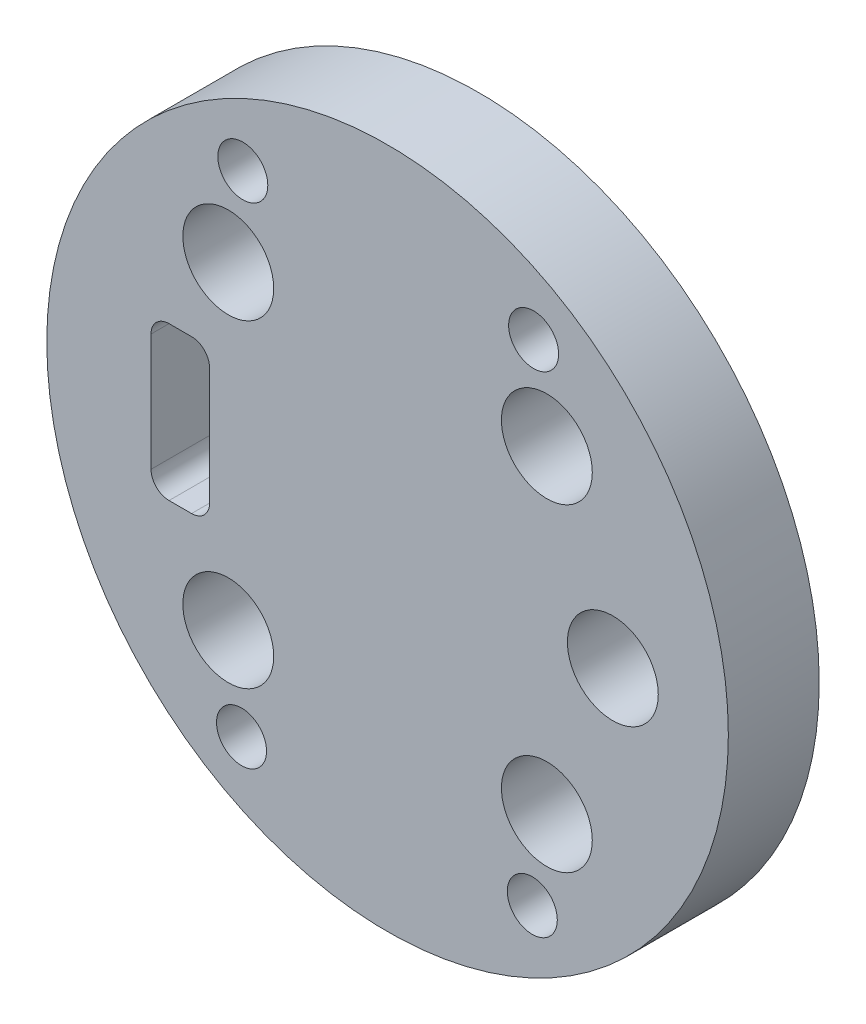
ISO-10303-21;
HEADER;
FILE_DESCRIPTION(('STEP AP214'),'2;1');
FILE_NAME('part.step','',(''),(''),'','','');
FILE_SCHEMA(('AUTOMOTIVE_DESIGN { 1 0 10303 214 1 1 1 1 }'));
ENDSEC;
DATA;
#1=APPLICATION_CONTEXT('core data for automotive mechanical design processes');
#2=APPLICATION_PROTOCOL_DEFINITION('international standard','automotive_design',2000,#1);
#3=PRODUCT_CONTEXT('',#1,'mechanical');
#4=PRODUCT('Part','Part','',(#3));
#5=PRODUCT_RELATED_PRODUCT_CATEGORY('part','',(#4));
#6=PRODUCT_DEFINITION_FORMATION('','',#4);
#7=PRODUCT_DEFINITION_CONTEXT('part definition',#1,'design');
#8=PRODUCT_DEFINITION('design','',#6,#7);
#9=PRODUCT_DEFINITION_SHAPE('','',#8);
#10=(LENGTH_UNIT() NAMED_UNIT(*) SI_UNIT(.MILLI.,.METRE.));
#11=(NAMED_UNIT(*) PLANE_ANGLE_UNIT() SI_UNIT($,.RADIAN.));
#12=(NAMED_UNIT(*) SI_UNIT($,.STERADIAN.) SOLID_ANGLE_UNIT());
#13=UNCERTAINTY_MEASURE_WITH_UNIT(LENGTH_MEASURE(1.E-05),#10,'distance_accuracy_value','');
#14=(GEOMETRIC_REPRESENTATION_CONTEXT(3) GLOBAL_UNCERTAINTY_ASSIGNED_CONTEXT((#13)) GLOBAL_UNIT_ASSIGNED_CONTEXT((#10,
#11,#12)) REPRESENTATION_CONTEXT('',''));
#15=CARTESIAN_POINT('',(0.,0.,0.));
#16=DIRECTION('',(0.,0.,1.));
#17=DIRECTION('',(1.,0.,0.));
#18=AXIS2_PLACEMENT_3D('',#15,#16,#17);
#19=CARTESIAN_POINT('',(-21.5665264060091,6.44516881099122,10.));
#20=DIRECTION('',(0.,0.,-1.));
#21=DIRECTION('',(-1.,0.,0.));
#22=AXIS2_PLACEMENT_3D('',#19,#20,#21);
#23=CYLINDRICAL_SURFACE('',#22,1.98312886492038);
#24=CARTESIAN_POINT('',(-21.5665264060091,6.44516881099122,0.));
#25=DIRECTION('',(0.,0.,1.));
#26=DIRECTION('',(1.,0.,0.));
#27=AXIS2_PLACEMENT_3D('',#24,#25,#26);
#28=CIRCLE('',#27,1.98312886492038);
#29=CARTESIAN_POINT('',(-19.5833975410887,6.44516881099122,0.));
#30=VERTEX_POINT('',#29);
#31=CARTESIAN_POINT('',(-21.5665264060091,8.42829767591159,0.));
#32=VERTEX_POINT('',#31);
#33=EDGE_CURVE('E144',#30,#32,#28,.T.);
#34=ORIENTED_EDGE('',*,*,#33,.F.);
#35=DIRECTION('',(0.,0.,-1.));
#36=VECTOR('',#35,1.);
#37=CARTESIAN_POINT('',(-19.5833975410887,6.44516881099122,10.));
#38=LINE('',#37,#36);
#39=CARTESIAN_POINT('',(-19.5833975410887,6.44516881099122,10.));
#40=VERTEX_POINT('',#39);
#41=EDGE_CURVE('E11',#40,#30,#38,.T.);
#42=ORIENTED_EDGE('',*,*,#41,.F.);
#43=CARTESIAN_POINT('',(-21.5665264060091,6.44516881099122,10.));
#44=DIRECTION('',(0.,0.,1.));
#45=DIRECTION('',(1.,0.,0.));
#46=AXIS2_PLACEMENT_3D('',#43,#44,#45);
#47=CIRCLE('',#46,1.98312886492038);
#48=CARTESIAN_POINT('',(-21.5665264060091,8.42829767591159,10.));
#49=VERTEX_POINT('',#48);
#50=EDGE_CURVE('E177',#40,#49,#47,.T.);
#51=ORIENTED_EDGE('',*,*,#50,.T.);
#52=DIRECTION('',(0.,0.,-1.));
#53=VECTOR('',#52,1.);
#54=CARTESIAN_POINT('',(-21.5665264060091,8.42829767591159,10.));
#55=LINE('',#54,#53);
#56=EDGE_CURVE('E58',#49,#32,#55,.T.);
#57=ORIENTED_EDGE('',*,*,#56,.T.);
#58=EDGE_LOOP('',(#34,#42,#51,#57));
#59=FACE_BOUND('',#58,.T.);
#60=ADVANCED_FACE('F41',(#59),#23,.F.);
#61=CARTESIAN_POINT('',(-19.5833975410887,0.,10.));
#62=DIRECTION('',(-1.,0.,0.));
#63=DIRECTION('',(0.,0.,1.));
#64=AXIS2_PLACEMENT_3D('',#61,#62,#63);
#65=PLANE('',#64);
#66=DIRECTION('',(0.,1.,0.));
#67=VECTOR('',#66,1.);
#68=CARTESIAN_POINT('',(-19.5833975410887,0.,0.));
#69=LINE('',#68,#67);
#70=CARTESIAN_POINT('',(-19.5833975410887,-6.44516881099122,0.));
#71=VERTEX_POINT('',#70);
#72=EDGE_CURVE('E147',#71,#30,#69,.T.);
#73=ORIENTED_EDGE('',*,*,#72,.F.);
#74=DIRECTION('',(0.,0.,-1.));
#75=VECTOR('',#74,1.);
#76=CARTESIAN_POINT('',(-19.5833975410887,-6.44516881099122,10.));
#77=LINE('',#76,#75);
#78=CARTESIAN_POINT('',(-19.5833975410887,-6.44516881099122,10.));
#79=VERTEX_POINT('',#78);
#80=EDGE_CURVE('E50',#79,#71,#77,.T.);
#81=ORIENTED_EDGE('',*,*,#80,.F.);
#82=DIRECTION('',(0.,1.,0.));
#83=VECTOR('',#82,1.);
#84=CARTESIAN_POINT('',(-19.5833975410887,0.,10.));
#85=LINE('',#84,#83);
#86=EDGE_CURVE('E210',#79,#40,#85,.T.);
#87=ORIENTED_EDGE('',*,*,#86,.T.);
#88=ORIENTED_EDGE('',*,*,#41,.T.);
#89=EDGE_LOOP('',(#73,#81,#87,#88));
#90=FACE_BOUND('',#89,.T.);
#91=ADVANCED_FACE('F200',(#90),#65,.T.);
#92=CARTESIAN_POINT('',(-21.5665264060091,-6.44516881099122,10.));
#93=DIRECTION('',(0.,0.,-1.));
#94=DIRECTION('',(-1.,0.,0.));
#95=AXIS2_PLACEMENT_3D('',#92,#93,#94);
#96=CYLINDRICAL_SURFACE('',#95,1.98312886492037);
#97=CARTESIAN_POINT('',(-21.5665264060091,-6.44516881099122,0.));
#98=DIRECTION('',(0.,0.,1.));
#99=DIRECTION('',(1.,0.,0.));
#100=AXIS2_PLACEMENT_3D('',#97,#98,#99);
#101=CIRCLE('',#100,1.98312886492037);
#102=CARTESIAN_POINT('',(-21.5665264060091,-8.42829767591159,0.));
#103=VERTEX_POINT('',#102);
#104=EDGE_CURVE('E152',#103,#71,#101,.T.);
#105=ORIENTED_EDGE('',*,*,#104,.F.);
#106=DIRECTION('',(0.,0.,-1.));
#107=VECTOR('',#106,1.);
#108=CARTESIAN_POINT('',(-21.5665264060091,-8.42829767591159,10.));
#109=LINE('',#108,#107);
#110=CARTESIAN_POINT('',(-21.5665264060091,-8.42829767591159,10.));
#111=VERTEX_POINT('',#110);
#112=EDGE_CURVE('E187',#111,#103,#109,.T.);
#113=ORIENTED_EDGE('',*,*,#112,.F.);
#114=CARTESIAN_POINT('',(-21.5665264060091,-6.44516881099122,10.));
#115=DIRECTION('',(0.,0.,1.));
#116=DIRECTION('',(1.,0.,0.));
#117=AXIS2_PLACEMENT_3D('',#114,#115,#116);
#118=CIRCLE('',#117,1.98312886492037);
#119=EDGE_CURVE('E196',#111,#79,#118,.T.);
#120=ORIENTED_EDGE('',*,*,#119,.T.);
#121=ORIENTED_EDGE('',*,*,#80,.T.);
#122=EDGE_LOOP('',(#105,#113,#120,#121));
#123=FACE_BOUND('',#122,.T.);
#124=ADVANCED_FACE('F194',(#123),#96,.F.);
#125=CARTESIAN_POINT('',(0.,-8.42829767591159,10.));
#126=DIRECTION('',(0.,1.,0.));
#127=DIRECTION('',(0.,0.,1.));
#128=AXIS2_PLACEMENT_3D('',#125,#126,#127);
#129=PLANE('',#128);
#130=DIRECTION('',(1.,0.,0.));
#131=VECTOR('',#130,1.);
#132=CARTESIAN_POINT('',(0.,-8.42829767591159,0.));
#133=LINE('',#132,#131);
#134=CARTESIAN_POINT('',(-24.0454374871595,-8.42829767591159,0.));
#135=VERTEX_POINT('',#134);
#136=EDGE_CURVE('E156',#135,#103,#133,.T.);
#137=ORIENTED_EDGE('',*,*,#136,.F.);
#138=DIRECTION('',(0.,0.,-1.));
#139=VECTOR('',#138,1.);
#140=CARTESIAN_POINT('',(-24.0454374871595,-8.42829767591159,10.));
#141=LINE('',#140,#139);
#142=CARTESIAN_POINT('',(-24.0454374871595,-8.42829767591159,10.));
#143=VERTEX_POINT('',#142);
#144=EDGE_CURVE('E184',#143,#135,#141,.T.);
#145=ORIENTED_EDGE('',*,*,#144,.F.);
#146=DIRECTION('',(1.,0.,0.));
#147=VECTOR('',#146,1.);
#148=CARTESIAN_POINT('',(0.,-8.42829767591159,10.));
#149=LINE('',#148,#147);
#150=EDGE_CURVE('E209',#143,#111,#149,.T.);
#151=ORIENTED_EDGE('',*,*,#150,.T.);
#152=ORIENTED_EDGE('',*,*,#112,.T.);
#153=EDGE_LOOP('',(#137,#145,#151,#152));
#154=FACE_BOUND('',#153,.T.);
#155=ADVANCED_FACE('F207',(#154),#129,.T.);
#156=CARTESIAN_POINT('',(-24.0454374871595,-6.44516881099122,10.));
#157=DIRECTION('',(0.,0.,-1.));
#158=DIRECTION('',(-1.,0.,0.));
#159=AXIS2_PLACEMENT_3D('',#156,#157,#158);
#160=CYLINDRICAL_SURFACE('',#159,1.98312886492037);
#161=CARTESIAN_POINT('',(-24.0454374871595,-6.44516881099122,0.));
#162=DIRECTION('',(0.,0.,1.));
#163=DIRECTION('',(1.,0.,0.));
#164=AXIS2_PLACEMENT_3D('',#161,#162,#163);
#165=CIRCLE('',#164,1.98312886492037);
#166=CARTESIAN_POINT('',(-26.0285663520799,-6.44516881099122,0.));
#167=VERTEX_POINT('',#166);
#168=EDGE_CURVE('E160',#167,#135,#165,.T.);
#169=ORIENTED_EDGE('',*,*,#168,.F.);
#170=DIRECTION('',(0.,0.,-1.));
#171=VECTOR('',#170,1.);
#172=CARTESIAN_POINT('',(-26.0285663520799,-6.44516881099122,10.));
#173=LINE('',#172,#171);
#174=CARTESIAN_POINT('',(-26.0285663520799,-6.44516881099122,10.));
#175=VERTEX_POINT('',#174);
#176=EDGE_CURVE('E118',#175,#167,#173,.T.);
#177=ORIENTED_EDGE('',*,*,#176,.F.);
#178=CARTESIAN_POINT('',(-24.0454374871595,-6.44516881099122,10.));
#179=DIRECTION('',(0.,0.,1.));
#180=DIRECTION('',(1.,0.,0.));
#181=AXIS2_PLACEMENT_3D('',#178,#179,#180);
#182=CIRCLE('',#181,1.98312886492037);
#183=EDGE_CURVE('E129',#175,#143,#182,.T.);
#184=ORIENTED_EDGE('',*,*,#183,.T.);
#185=ORIENTED_EDGE('',*,*,#144,.T.);
#186=EDGE_LOOP('',(#169,#177,#184,#185));
#187=FACE_BOUND('',#186,.T.);
#188=ADVANCED_FACE('F220',(#187),#160,.F.);
#189=CARTESIAN_POINT('',(-26.0285663520799,0.,10.));
#190=DIRECTION('',(1.,0.,0.));
#191=DIRECTION('',(0.,0.,-1.));
#192=AXIS2_PLACEMENT_3D('',#189,#190,#191);
#193=PLANE('',#192);
#194=DIRECTION('',(0.,-1.,0.));
#195=VECTOR('',#194,1.);
#196=CARTESIAN_POINT('',(-26.0285663520799,0.,0.));
#197=LINE('',#196,#195);
#198=CARTESIAN_POINT('',(-26.0285663520799,6.44516881099122,0.));
#199=VERTEX_POINT('',#198);
#200=EDGE_CURVE('E113',#199,#167,#197,.T.);
#201=ORIENTED_EDGE('',*,*,#200,.F.);
#202=DIRECTION('',(0.,0.,-1.));
#203=VECTOR('',#202,1.);
#204=CARTESIAN_POINT('',(-26.0285663520799,6.44516881099122,10.));
#205=LINE('',#204,#203);
#206=CARTESIAN_POINT('',(-26.0285663520799,6.44516881099122,10.));
#207=VERTEX_POINT('',#206);
#208=EDGE_CURVE('E108',#207,#199,#205,.T.);
#209=ORIENTED_EDGE('',*,*,#208,.F.);
#210=DIRECTION('',(0.,-1.,0.));
#211=VECTOR('',#210,1.);
#212=CARTESIAN_POINT('',(-26.0285663520799,0.,10.));
#213=LINE('',#212,#211);
#214=EDGE_CURVE('E111',#207,#175,#213,.T.);
#215=ORIENTED_EDGE('',*,*,#214,.T.);
#216=ORIENTED_EDGE('',*,*,#176,.T.);
#217=EDGE_LOOP('',(#201,#209,#215,#216));
#218=FACE_BOUND('',#217,.T.);
#219=ADVANCED_FACE('F110',(#218),#193,.T.);
#220=CARTESIAN_POINT('',(-24.0454374871595,6.44516881099122,10.));
#221=DIRECTION('',(0.,0.,-1.));
#222=DIRECTION('',(-1.,0.,0.));
#223=AXIS2_PLACEMENT_3D('',#220,#221,#222);
#224=CYLINDRICAL_SURFACE('',#223,1.98312886492037);
#225=CARTESIAN_POINT('',(-24.0454374871595,6.44516881099122,0.));
#226=DIRECTION('',(0.,0.,1.));
#227=DIRECTION('',(1.,0.,0.));
#228=AXIS2_PLACEMENT_3D('',#225,#226,#227);
#229=CIRCLE('',#228,1.98312886492037);
#230=CARTESIAN_POINT('',(-24.0454374871595,8.42829767591159,0.));
#231=VERTEX_POINT('',#230);
#232=EDGE_CURVE('E166',#231,#199,#229,.T.);
#233=ORIENTED_EDGE('',*,*,#232,.F.);
#234=DIRECTION('',(0.,0.,-1.));
#235=VECTOR('',#234,1.);
#236=CARTESIAN_POINT('',(-24.0454374871595,8.42829767591159,10.));
#237=LINE('',#236,#235);
#238=CARTESIAN_POINT('',(-24.0454374871595,8.42829767591159,10.));
#239=VERTEX_POINT('',#238);
#240=EDGE_CURVE('E83',#239,#231,#237,.T.);
#241=ORIENTED_EDGE('',*,*,#240,.F.);
#242=CARTESIAN_POINT('',(-24.0454374871595,6.44516881099122,10.));
#243=DIRECTION('',(0.,0.,1.));
#244=DIRECTION('',(1.,0.,0.));
#245=AXIS2_PLACEMENT_3D('',#242,#243,#244);
#246=CIRCLE('',#245,1.98312886492037);
#247=EDGE_CURVE('E126',#239,#207,#246,.T.);
#248=ORIENTED_EDGE('',*,*,#247,.T.);
#249=ORIENTED_EDGE('',*,*,#208,.T.);
#250=EDGE_LOOP('',(#233,#241,#248,#249));
#251=FACE_BOUND('',#250,.T.);
#252=ADVANCED_FACE('F132',(#251),#224,.F.);
#253=CARTESIAN_POINT('',(0.,8.42829767591159,10.));
#254=DIRECTION('',(0.,-1.,0.));
#255=DIRECTION('',(0.,0.,-1.));
#256=AXIS2_PLACEMENT_3D('',#253,#254,#255);
#257=PLANE('',#256);
#258=DIRECTION('',(-1.,0.,0.));
#259=VECTOR('',#258,1.);
#260=CARTESIAN_POINT('',(0.,8.42829767591159,0.));
#261=LINE('',#260,#259);
#262=EDGE_CURVE('E169',#32,#231,#261,.T.);
#263=ORIENTED_EDGE('',*,*,#262,.F.);
#264=ORIENTED_EDGE('',*,*,#56,.F.);
#265=DIRECTION('',(-1.,0.,0.));
#266=VECTOR('',#265,1.);
#267=CARTESIAN_POINT('',(0.,8.42829767591159,10.));
#268=LINE('',#267,#266);
#269=EDGE_CURVE('E134',#49,#239,#268,.T.);
#270=ORIENTED_EDGE('',*,*,#269,.T.);
#271=ORIENTED_EDGE('',*,*,#240,.T.);
#272=EDGE_LOOP('',(#263,#264,#270,#271));
#273=FACE_BOUND('',#272,.T.);
#274=ADVANCED_FACE('F221',(#273),#257,.T.);
#275=CARTESIAN_POINT('',(0.,0.,10.));
#276=DIRECTION('',(0.,0.,-1.));
#277=DIRECTION('',(-1.,0.,0.));
#278=AXIS2_PLACEMENT_3D('',#275,#276,#277);
#279=CYLINDRICAL_SURFACE('',#278,37.5);
#280=CARTESIAN_POINT('',(0.,0.,10.));
#281=DIRECTION('',(0.,0.,1.));
#282=DIRECTION('',(1.,0.,0.));
#283=AXIS2_PLACEMENT_3D('',#280,#281,#282);
#284=CIRCLE('',#283,37.5);
#285=CARTESIAN_POINT('',(37.5,0.,10.));
#286=VERTEX_POINT('',#285);
#287=EDGE_CURVE('E137',#286,#286,#284,.T.);
#288=ORIENTED_EDGE('',*,*,#287,.F.);
#289=EDGE_LOOP('',(#288));
#290=FACE_BOUND('',#289,.T.);
#291=CARTESIAN_POINT('',(0.,0.,0.));
#292=DIRECTION('',(0.,0.,1.));
#293=DIRECTION('',(1.,0.,0.));
#294=AXIS2_PLACEMENT_3D('',#291,#292,#293);
#295=CIRCLE('',#294,37.5);
#296=CARTESIAN_POINT('',(37.5,0.,0.));
#297=VERTEX_POINT('',#296);
#298=EDGE_CURVE('E173',#297,#297,#295,.T.);
#299=ORIENTED_EDGE('',*,*,#298,.T.);
#300=EDGE_LOOP('',(#299));
#301=FACE_BOUND('',#300,.T.);
#302=ADVANCED_FACE('F223',(#290,#301),#279,.T.);
#303=CARTESIAN_POINT('',(0.,0.,10.));
#304=DIRECTION('',(0.,0.,1.));
#305=DIRECTION('',(1.,0.,0.));
#306=AXIS2_PLACEMENT_3D('',#303,#304,#305);
#307=PLANE('',#306);
#308=CARTESIAN_POINT('',(-15.9288241092373,27.0420517434788,10.));
#309=DIRECTION('',(0.,0.,1.));
#310=DIRECTION('',(1.,0.,0.));
#311=AXIS2_PLACEMENT_3D('',#308,#309,#310);
#312=CIRCLE('',#311,2.75);
#313=CARTESIAN_POINT('',(-13.1788241092373,27.0420517434788,10.));
#314=VERTEX_POINT('',#313);
#315=EDGE_CURVE('E382',#314,#314,#312,.T.);
#316=ORIENTED_EDGE('',*,*,#315,.F.);
#317=EDGE_LOOP('',(#316));
#318=FACE_BOUND('',#317,.T.);
#319=CARTESIAN_POINT('',(16.0710648758339,26.9577609188289,10.));
#320=DIRECTION('',(0.,0.,1.));
#321=DIRECTION('',(1.,0.,0.));
#322=AXIS2_PLACEMENT_3D('',#319,#320,#321);
#323=CIRCLE('',#322,2.74999999999999);
#324=CARTESIAN_POINT('',(18.8210648758339,26.9577609188289,10.));
#325=VERTEX_POINT('',#324);
#326=EDGE_CURVE('E386',#325,#325,#323,.T.);
#327=ORIENTED_EDGE('',*,*,#326,.F.);
#328=EDGE_LOOP('',(#327));
#329=FACE_BOUND('',#328,.T.);
#330=CARTESIAN_POINT('',(15.9288241092373,-27.0420517434787,10.));
#331=DIRECTION('',(0.,0.,1.));
#332=DIRECTION('',(1.,0.,0.));
#333=AXIS2_PLACEMENT_3D('',#330,#331,#332);
#334=CIRCLE('',#333,2.75);
#335=CARTESIAN_POINT('',(18.6788241092373,-27.0420517434787,10.));
#336=VERTEX_POINT('',#335);
#337=EDGE_CURVE('E441',#336,#336,#334,.T.);
#338=ORIENTED_EDGE('',*,*,#337,.F.);
#339=EDGE_LOOP('',(#338));
#340=FACE_BOUND('',#339,.T.);
#341=CARTESIAN_POINT('',(-16.0710648758339,-26.9577609188289,10.));
#342=DIRECTION('',(0.,0.,1.));
#343=DIRECTION('',(1.,0.,0.));
#344=AXIS2_PLACEMENT_3D('',#341,#342,#343);
#345=CIRCLE('',#344,2.74999999999999);
#346=CARTESIAN_POINT('',(-13.3210648758339,-26.9577609188289,10.));
#347=VERTEX_POINT('',#346);
#348=EDGE_CURVE('E395',#347,#347,#345,.T.);
#349=ORIENTED_EDGE('',*,*,#348,.F.);
#350=EDGE_LOOP('',(#349));
#351=FACE_BOUND('',#350,.T.);
#352=CARTESIAN_POINT('',(17.5285483543997,17.5285483543997,10.));
#353=DIRECTION('',(0.,0.,1.));
#354=DIRECTION('',(1.,0.,0.));
#355=AXIS2_PLACEMENT_3D('',#352,#353,#354);
#356=CIRCLE('',#355,5.);
#357=CARTESIAN_POINT('',(22.5285483543997,17.5285483543997,10.));
#358=VERTEX_POINT('',#357);
#359=EDGE_CURVE('E421',#358,#358,#356,.T.);
#360=ORIENTED_EDGE('',*,*,#359,.F.);
#361=EDGE_LOOP('',(#360));
#362=FACE_BOUND('',#361,.T.);
#363=CARTESIAN_POINT('',(-17.5285483543997,-17.5285483543997,10.));
#364=DIRECTION('',(0.,0.,1.));
#365=DIRECTION('',(1.,0.,0.));
#366=AXIS2_PLACEMENT_3D('',#363,#364,#365);
#367=CIRCLE('',#366,5.);
#368=CARTESIAN_POINT('',(-12.5285483543997,-17.5285483543997,10.));
#369=VERTEX_POINT('',#368);
#370=EDGE_CURVE('E404',#369,#369,#367,.T.);
#371=ORIENTED_EDGE('',*,*,#370,.F.);
#372=EDGE_LOOP('',(#371));
#373=FACE_BOUND('',#372,.T.);
#374=CARTESIAN_POINT('',(17.5285483543997,-17.5285483543997,10.));
#375=DIRECTION('',(0.,0.,1.));
#376=DIRECTION('',(1.,0.,0.));
#377=AXIS2_PLACEMENT_3D('',#374,#375,#376);
#378=CIRCLE('',#377,5.);
#379=CARTESIAN_POINT('',(22.5285483543997,-17.5285483543997,10.));
#380=VERTEX_POINT('',#379);
#381=EDGE_CURVE('E405',#380,#380,#378,.T.);
#382=ORIENTED_EDGE('',*,*,#381,.F.);
#383=EDGE_LOOP('',(#382));
#384=FACE_BOUND('',#383,.T.);
#385=CARTESIAN_POINT('',(24.7891108115047,0.,10.));
#386=DIRECTION('',(0.,0.,1.));
#387=DIRECTION('',(1.,0.,0.));
#388=AXIS2_PLACEMENT_3D('',#385,#386,#387);
#389=CIRCLE('',#388,5.);
#390=CARTESIAN_POINT('',(29.7891108115047,0.,10.));
#391=VERTEX_POINT('',#390);
#392=EDGE_CURVE('E394',#391,#391,#389,.T.);
#393=ORIENTED_EDGE('',*,*,#392,.F.);
#394=EDGE_LOOP('',(#393));
#395=FACE_BOUND('',#394,.T.);
#396=CARTESIAN_POINT('',(-17.5285483543997,17.5285483543997,10.));
#397=DIRECTION('',(0.,0.,1.));
#398=DIRECTION('',(1.,0.,0.));
#399=AXIS2_PLACEMENT_3D('',#396,#397,#398);
#400=CIRCLE('',#399,5.);
#401=CARTESIAN_POINT('',(-12.5285483543997,17.5285483543997,10.));
#402=VERTEX_POINT('',#401);
#403=EDGE_CURVE('E420',#402,#402,#400,.T.);
#404=ORIENTED_EDGE('',*,*,#403,.F.);
#405=EDGE_LOOP('',(#404));
#406=FACE_BOUND('',#405,.T.);
#407=ORIENTED_EDGE('',*,*,#50,.F.);
#408=ORIENTED_EDGE('',*,*,#86,.F.);
#409=ORIENTED_EDGE('',*,*,#119,.F.);
#410=ORIENTED_EDGE('',*,*,#150,.F.);
#411=ORIENTED_EDGE('',*,*,#183,.F.);
#412=ORIENTED_EDGE('',*,*,#214,.F.);
#413=ORIENTED_EDGE('',*,*,#247,.F.);
#414=ORIENTED_EDGE('',*,*,#269,.F.);
#415=EDGE_LOOP('',(#407,#408,#409,#410,#411,#412,#413,#414));
#416=FACE_BOUND('',#415,.T.);
#417=ORIENTED_EDGE('',*,*,#287,.T.);
#418=EDGE_LOOP('',(#417));
#419=FACE_BOUND('',#418,.T.);
#420=ADVANCED_FACE('F123',(#318,#329,#340,#351,#362,#373,#384,#395,#406,#416,#419),#307,.T.);
#421=CARTESIAN_POINT('',(0.,0.,0.));
#422=DIRECTION('',(0.,0.,1.));
#423=DIRECTION('',(1.,0.,0.));
#424=AXIS2_PLACEMENT_3D('',#421,#422,#423);
#425=PLANE('',#424);
#426=CARTESIAN_POINT('',(-15.9288241092373,27.0420517434788,0.));
#427=DIRECTION('',(0.,0.,1.));
#428=DIRECTION('',(1.,0.,0.));
#429=AXIS2_PLACEMENT_3D('',#426,#427,#428);
#430=CIRCLE('',#429,2.75);
#431=CARTESIAN_POINT('',(-13.1788241092373,27.0420517434788,0.));
#432=VERTEX_POINT('',#431);
#433=EDGE_CURVE('E379',#432,#432,#430,.T.);
#434=ORIENTED_EDGE('',*,*,#433,.T.);
#435=EDGE_LOOP('',(#434));
#436=FACE_BOUND('',#435,.T.);
#437=CARTESIAN_POINT('',(16.0710648758339,26.9577609188289,0.));
#438=DIRECTION('',(0.,0.,1.));
#439=DIRECTION('',(1.,0.,0.));
#440=AXIS2_PLACEMENT_3D('',#437,#438,#439);
#441=CIRCLE('',#440,2.74999999999999);
#442=CARTESIAN_POINT('',(18.8210648758339,26.9577609188289,0.));
#443=VERTEX_POINT('',#442);
#444=EDGE_CURVE('E445',#443,#443,#441,.T.);
#445=ORIENTED_EDGE('',*,*,#444,.T.);
#446=EDGE_LOOP('',(#445));
#447=FACE_BOUND('',#446,.T.);
#448=CARTESIAN_POINT('',(15.9288241092373,-27.0420517434787,0.));
#449=DIRECTION('',(0.,0.,1.));
#450=DIRECTION('',(1.,0.,0.));
#451=AXIS2_PLACEMENT_3D('',#448,#449,#450);
#452=CIRCLE('',#451,2.75);
#453=CARTESIAN_POINT('',(18.6788241092373,-27.0420517434787,0.));
#454=VERTEX_POINT('',#453);
#455=EDGE_CURVE('E399',#454,#454,#452,.T.);
#456=ORIENTED_EDGE('',*,*,#455,.T.);
#457=EDGE_LOOP('',(#456));
#458=FACE_BOUND('',#457,.T.);
#459=CARTESIAN_POINT('',(-16.0710648758339,-26.9577609188289,0.));
#460=DIRECTION('',(0.,0.,1.));
#461=DIRECTION('',(1.,0.,0.));
#462=AXIS2_PLACEMENT_3D('',#459,#460,#461);
#463=CIRCLE('',#462,2.74999999999999);
#464=CARTESIAN_POINT('',(-13.3210648758339,-26.9577609188289,0.));
#465=VERTEX_POINT('',#464);
#466=EDGE_CURVE('E390',#465,#465,#463,.T.);
#467=ORIENTED_EDGE('',*,*,#466,.T.);
#468=EDGE_LOOP('',(#467));
#469=FACE_BOUND('',#468,.T.);
#470=CARTESIAN_POINT('',(17.5285483543997,17.5285483543997,0.));
#471=DIRECTION('',(0.,0.,1.));
#472=DIRECTION('',(1.,0.,0.));
#473=AXIS2_PLACEMENT_3D('',#470,#471,#472);
#474=CIRCLE('',#473,5.);
#475=CARTESIAN_POINT('',(22.5285483543997,17.5285483543997,0.));
#476=VERTEX_POINT('',#475);
#477=EDGE_CURVE('E416',#476,#476,#474,.T.);
#478=ORIENTED_EDGE('',*,*,#477,.T.);
#479=EDGE_LOOP('',(#478));
#480=FACE_BOUND('',#479,.T.);
#481=CARTESIAN_POINT('',(-17.5285483543997,-17.5285483543997,0.));
#482=DIRECTION('',(0.,0.,1.));
#483=DIRECTION('',(1.,0.,0.));
#484=AXIS2_PLACEMENT_3D('',#481,#482,#483);
#485=CIRCLE('',#484,5.);
#486=CARTESIAN_POINT('',(-12.5285483543997,-17.5285483543997,0.));
#487=VERTEX_POINT('',#486);
#488=EDGE_CURVE('E425',#487,#487,#485,.T.);
#489=ORIENTED_EDGE('',*,*,#488,.T.);
#490=EDGE_LOOP('',(#489));
#491=FACE_BOUND('',#490,.T.);
#492=CARTESIAN_POINT('',(17.5285483543997,-17.5285483543997,0.));
#493=DIRECTION('',(0.,0.,1.));
#494=DIRECTION('',(1.,0.,0.));
#495=AXIS2_PLACEMENT_3D('',#492,#493,#494);
#496=CIRCLE('',#495,5.);
#497=CARTESIAN_POINT('',(22.5285483543997,-17.5285483543997,0.));
#498=VERTEX_POINT('',#497);
#499=EDGE_CURVE('E400',#498,#498,#496,.T.);
#500=ORIENTED_EDGE('',*,*,#499,.T.);
#501=EDGE_LOOP('',(#500));
#502=FACE_BOUND('',#501,.T.);
#503=CARTESIAN_POINT('',(24.7891108115047,0.,0.));
#504=DIRECTION('',(0.,0.,1.));
#505=DIRECTION('',(1.,0.,0.));
#506=AXIS2_PLACEMENT_3D('',#503,#504,#505);
#507=CIRCLE('',#506,5.);
#508=CARTESIAN_POINT('',(29.7891108115047,0.,0.));
#509=VERTEX_POINT('',#508);
#510=EDGE_CURVE('E409',#509,#509,#507,.T.);
#511=ORIENTED_EDGE('',*,*,#510,.T.);
#512=EDGE_LOOP('',(#511));
#513=FACE_BOUND('',#512,.T.);
#514=CARTESIAN_POINT('',(-17.5285483543997,17.5285483543997,0.));
#515=DIRECTION('',(0.,0.,1.));
#516=DIRECTION('',(1.,0.,0.));
#517=AXIS2_PLACEMENT_3D('',#514,#515,#516);
#518=CIRCLE('',#517,5.);
#519=CARTESIAN_POINT('',(-12.5285483543997,17.5285483543997,0.));
#520=VERTEX_POINT('',#519);
#521=EDGE_CURVE('E148',#520,#520,#518,.T.);
#522=ORIENTED_EDGE('',*,*,#521,.T.);
#523=EDGE_LOOP('',(#522));
#524=FACE_BOUND('',#523,.T.);
#525=ORIENTED_EDGE('',*,*,#33,.T.);
#526=ORIENTED_EDGE('',*,*,#262,.T.);
#527=ORIENTED_EDGE('',*,*,#232,.T.);
#528=ORIENTED_EDGE('',*,*,#200,.T.);
#529=ORIENTED_EDGE('',*,*,#168,.T.);
#530=ORIENTED_EDGE('',*,*,#136,.T.);
#531=ORIENTED_EDGE('',*,*,#104,.T.);
#532=ORIENTED_EDGE('',*,*,#72,.T.);
#533=EDGE_LOOP('',(#525,#526,#527,#528,#529,#530,#531,#532));
#534=FACE_BOUND('',#533,.T.);
#535=ORIENTED_EDGE('',*,*,#298,.F.);
#536=EDGE_LOOP('',(#535));
#537=FACE_BOUND('',#536,.T.);
#538=ADVANCED_FACE('F202',(#436,#447,#458,#469,#480,#491,#502,#513,#524,#534,#537),#425,.F.);
#539=CARTESIAN_POINT('',(-17.5285483543997,17.5285483543997,0.));
#540=DIRECTION('',(0.,0.,1.));
#541=DIRECTION('',(1.,0.,0.));
#542=AXIS2_PLACEMENT_3D('',#539,#540,#541);
#543=CYLINDRICAL_SURFACE('',#542,5.);
#544=ORIENTED_EDGE('',*,*,#521,.F.);
#545=EDGE_LOOP('',(#544));
#546=FACE_BOUND('',#545,.T.);
#547=ORIENTED_EDGE('',*,*,#403,.T.);
#548=EDGE_LOOP('',(#547));
#549=FACE_BOUND('',#548,.T.);
#550=ADVANCED_FACE('F271',(#546,#549),#543,.F.);
#551=CARTESIAN_POINT('',(24.7891108115047,0.,0.));
#552=DIRECTION('',(0.,0.,1.));
#553=DIRECTION('',(1.,0.,0.));
#554=AXIS2_PLACEMENT_3D('',#551,#552,#553);
#555=CYLINDRICAL_SURFACE('',#554,5.);
#556=ORIENTED_EDGE('',*,*,#510,.F.);
#557=EDGE_LOOP('',(#556));
#558=FACE_BOUND('',#557,.T.);
#559=ORIENTED_EDGE('',*,*,#392,.T.);
#560=EDGE_LOOP('',(#559));
#561=FACE_BOUND('',#560,.T.);
#562=ADVANCED_FACE('F276',(#558,#561),#555,.F.);
#563=CARTESIAN_POINT('',(17.5285483543997,-17.5285483543997,0.));
#564=DIRECTION('',(0.,0.,1.));
#565=DIRECTION('',(1.,0.,0.));
#566=AXIS2_PLACEMENT_3D('',#563,#564,#565);
#567=CYLINDRICAL_SURFACE('',#566,5.);
#568=ORIENTED_EDGE('',*,*,#499,.F.);
#569=EDGE_LOOP('',(#568));
#570=FACE_BOUND('',#569,.T.);
#571=ORIENTED_EDGE('',*,*,#381,.T.);
#572=EDGE_LOOP('',(#571));
#573=FACE_BOUND('',#572,.T.);
#574=ADVANCED_FACE('F288',(#570,#573),#567,.F.);
#575=CARTESIAN_POINT('',(-17.5285483543997,-17.5285483543997,0.));
#576=DIRECTION('',(0.,0.,1.));
#577=DIRECTION('',(1.,0.,0.));
#578=AXIS2_PLACEMENT_3D('',#575,#576,#577);
#579=CYLINDRICAL_SURFACE('',#578,5.);
#580=ORIENTED_EDGE('',*,*,#488,.F.);
#581=EDGE_LOOP('',(#580));
#582=FACE_BOUND('',#581,.T.);
#583=ORIENTED_EDGE('',*,*,#370,.T.);
#584=EDGE_LOOP('',(#583));
#585=FACE_BOUND('',#584,.T.);
#586=ADVANCED_FACE('F298',(#582,#585),#579,.F.);
#587=CARTESIAN_POINT('',(17.5285483543997,17.5285483543997,0.));
#588=DIRECTION('',(0.,0.,1.));
#589=DIRECTION('',(1.,0.,0.));
#590=AXIS2_PLACEMENT_3D('',#587,#588,#589);
#591=CYLINDRICAL_SURFACE('',#590,5.);
#592=ORIENTED_EDGE('',*,*,#477,.F.);
#593=EDGE_LOOP('',(#592));
#594=FACE_BOUND('',#593,.T.);
#595=ORIENTED_EDGE('',*,*,#359,.T.);
#596=EDGE_LOOP('',(#595));
#597=FACE_BOUND('',#596,.T.);
#598=ADVANCED_FACE('F308',(#594,#597),#591,.F.);
#599=CARTESIAN_POINT('',(-16.0710648758339,-26.9577609188289,0.));
#600=DIRECTION('',(0.,0.,1.));
#601=DIRECTION('',(1.,0.,0.));
#602=AXIS2_PLACEMENT_3D('',#599,#600,#601);
#603=CYLINDRICAL_SURFACE('',#602,2.74999999999999);
#604=ORIENTED_EDGE('',*,*,#466,.F.);
#605=EDGE_LOOP('',(#604));
#606=FACE_BOUND('',#605,.T.);
#607=ORIENTED_EDGE('',*,*,#348,.T.);
#608=EDGE_LOOP('',(#607));
#609=FACE_BOUND('',#608,.T.);
#610=ADVANCED_FACE('F318',(#606,#609),#603,.F.);
#611=CARTESIAN_POINT('',(15.9288241092373,-27.0420517434787,0.));
#612=DIRECTION('',(0.,0.,1.));
#613=DIRECTION('',(1.,0.,0.));
#614=AXIS2_PLACEMENT_3D('',#611,#612,#613);
#615=CYLINDRICAL_SURFACE('',#614,2.75);
#616=ORIENTED_EDGE('',*,*,#455,.F.);
#617=EDGE_LOOP('',(#616));
#618=FACE_BOUND('',#617,.T.);
#619=ORIENTED_EDGE('',*,*,#337,.T.);
#620=EDGE_LOOP('',(#619));
#621=FACE_BOUND('',#620,.T.);
#622=ADVANCED_FACE('F342',(#618,#621),#615,.F.);
#623=CARTESIAN_POINT('',(16.0710648758339,26.9577609188289,0.));
#624=DIRECTION('',(0.,0.,1.));
#625=DIRECTION('',(1.,0.,0.));
#626=AXIS2_PLACEMENT_3D('',#623,#624,#625);
#627=CYLINDRICAL_SURFACE('',#626,2.74999999999999);
#628=ORIENTED_EDGE('',*,*,#444,.F.);
#629=EDGE_LOOP('',(#628));
#630=FACE_BOUND('',#629,.T.);
#631=ORIENTED_EDGE('',*,*,#326,.T.);
#632=EDGE_LOOP('',(#631));
#633=FACE_BOUND('',#632,.T.);
#634=ADVANCED_FACE('F352',(#630,#633),#627,.F.);
#635=CARTESIAN_POINT('',(-15.9288241092373,27.0420517434788,0.));
#636=DIRECTION('',(0.,0.,1.));
#637=DIRECTION('',(1.,0.,0.));
#638=AXIS2_PLACEMENT_3D('',#635,#636,#637);
#639=CYLINDRICAL_SURFACE('',#638,2.75);
#640=ORIENTED_EDGE('',*,*,#433,.F.);
#641=EDGE_LOOP('',(#640));
#642=FACE_BOUND('',#641,.T.);
#643=ORIENTED_EDGE('',*,*,#315,.T.);
#644=EDGE_LOOP('',(#643));
#645=FACE_BOUND('',#644,.T.);
#646=ADVANCED_FACE('F362',(#642,#645),#639,.F.);
#647=CLOSED_SHELL('',(#60,#91,#124,#155,#188,#219,#252,#274,#302,#420,#538,#550,#562,#574,#586,
#598,#610,#622,#634,#646));
#648=MANIFOLD_SOLID_BREP('B2',#647);
#649=ADVANCED_BREP_SHAPE_REPRESENTATION('',(#18,#648),#14);
#650=SHAPE_DEFINITION_REPRESENTATION(#9,#649);
ENDSEC;
END-ISO-10303-21;
